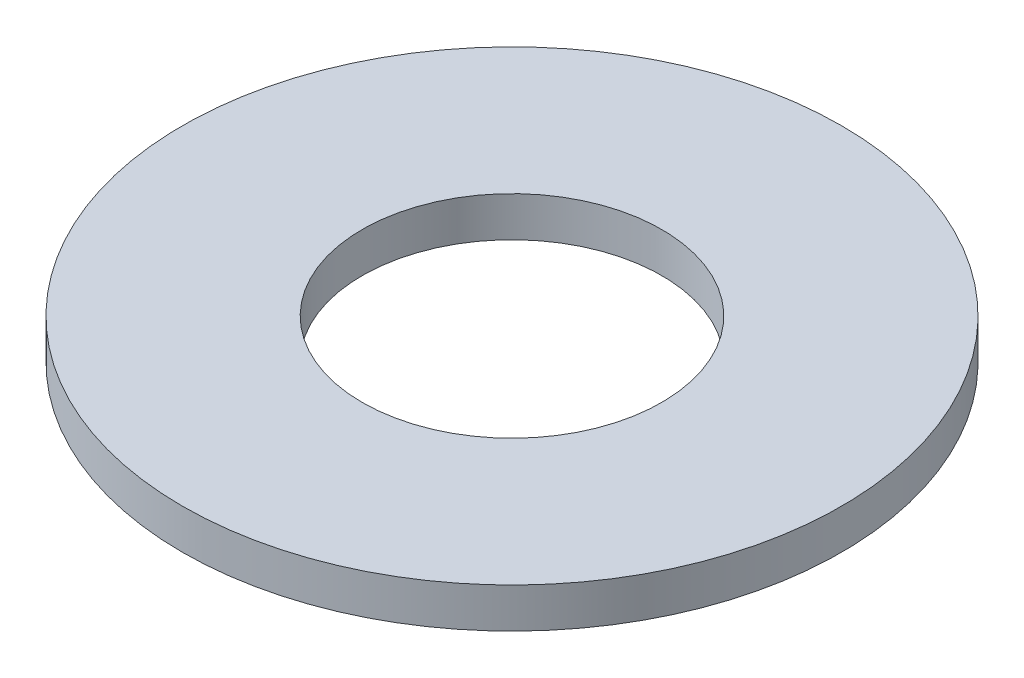
ISO-10303-21;
HEADER;
FILE_DESCRIPTION(('STEP AP214'),'2;1');
FILE_NAME('part.step','',(''),(''),'','','');
FILE_SCHEMA(('AUTOMOTIVE_DESIGN { 1 0 10303 214 1 1 1 1 }'));
ENDSEC;
DATA;
#1=APPLICATION_CONTEXT('core data for automotive mechanical design processes');
#2=APPLICATION_PROTOCOL_DEFINITION('international standard','automotive_design',2000,#1);
#3=PRODUCT_CONTEXT('',#1,'mechanical');
#4=PRODUCT('Part','Part','',(#3));
#5=PRODUCT_RELATED_PRODUCT_CATEGORY('part','',(#4));
#6=PRODUCT_DEFINITION_FORMATION('','',#4);
#7=PRODUCT_DEFINITION_CONTEXT('part definition',#1,'design');
#8=PRODUCT_DEFINITION('design','',#6,#7);
#9=PRODUCT_DEFINITION_SHAPE('','',#8);
#10=(LENGTH_UNIT() NAMED_UNIT(*) SI_UNIT(.MILLI.,.METRE.));
#11=(NAMED_UNIT(*) PLANE_ANGLE_UNIT() SI_UNIT($,.RADIAN.));
#12=(NAMED_UNIT(*) SI_UNIT($,.STERADIAN.) SOLID_ANGLE_UNIT());
#13=UNCERTAINTY_MEASURE_WITH_UNIT(LENGTH_MEASURE(1.E-05),#10,'distance_accuracy_value','');
#14=(GEOMETRIC_REPRESENTATION_CONTEXT(3) GLOBAL_UNCERTAINTY_ASSIGNED_CONTEXT((#13)) GLOBAL_UNIT_ASSIGNED_CONTEXT((#10,
#11,#12)) REPRESENTATION_CONTEXT('',''));
#15=CARTESIAN_POINT('',(0.,0.,0.));
#16=DIRECTION('',(0.,0.,1.));
#17=DIRECTION('',(1.,0.,0.));
#18=AXIS2_PLACEMENT_3D('',#15,#16,#17);
#19=CARTESIAN_POINT('',(0.,5.,0.));
#20=DIRECTION('',(0.,1.,0.));
#21=DIRECTION('',(0.,0.,1.));
#22=AXIS2_PLACEMENT_3D('',#19,#20,#21);
#23=PLANE('',#22);
#24=CARTESIAN_POINT('',(0.,5.,0.));
#25=DIRECTION('',(0.,1.,0.));
#26=DIRECTION('',(0.,0.,1.));
#27=AXIS2_PLACEMENT_3D('',#24,#25,#26);
#28=CIRCLE('',#27,82.5);
#29=CARTESIAN_POINT('',(0.,5.,82.5));
#30=VERTEX_POINT('',#29);
#31=EDGE_CURVE('E10',#30,#30,#28,.T.);
#32=ORIENTED_EDGE('',*,*,#31,.T.);
#33=EDGE_LOOP('',(#32));
#34=FACE_BOUND('',#33,.T.);
#35=CARTESIAN_POINT('',(0.,5.,0.));
#36=DIRECTION('',(0.,1.,0.));
#37=DIRECTION('',(0.,0.,1.));
#38=AXIS2_PLACEMENT_3D('',#35,#36,#37);
#39=CIRCLE('',#38,37.5);
#40=CARTESIAN_POINT('',(0.,5.,37.5));
#41=VERTEX_POINT('',#40);
#42=EDGE_CURVE('E42',#41,#41,#39,.T.);
#43=ORIENTED_EDGE('',*,*,#42,.F.);
#44=EDGE_LOOP('',(#43));
#45=FACE_BOUND('',#44,.T.);
#46=ADVANCED_FACE('F31',(#34,#45),#23,.T.);
#47=CARTESIAN_POINT('',(0.,-5.,0.));
#48=DIRECTION('',(0.,1.,0.));
#49=DIRECTION('',(0.,0.,1.));
#50=AXIS2_PLACEMENT_3D('',#47,#48,#49);
#51=PLANE('',#50);
#52=CARTESIAN_POINT('',(0.,-5.,0.));
#53=DIRECTION('',(0.,1.,0.));
#54=DIRECTION('',(0.,0.,1.));
#55=AXIS2_PLACEMENT_3D('',#52,#53,#54);
#56=CIRCLE('',#55,82.5);
#57=CARTESIAN_POINT('',(0.,-5.,82.5));
#58=VERTEX_POINT('',#57);
#59=EDGE_CURVE('E35',#58,#58,#56,.T.);
#60=ORIENTED_EDGE('',*,*,#59,.F.);
#61=EDGE_LOOP('',(#60));
#62=FACE_BOUND('',#61,.T.);
#63=CARTESIAN_POINT('',(0.,-5.,0.));
#64=DIRECTION('',(0.,1.,0.));
#65=DIRECTION('',(0.,0.,1.));
#66=AXIS2_PLACEMENT_3D('',#63,#64,#65);
#67=CIRCLE('',#66,37.5);
#68=CARTESIAN_POINT('',(0.,-5.,37.5));
#69=VERTEX_POINT('',#68);
#70=EDGE_CURVE('E44',#69,#69,#67,.T.);
#71=ORIENTED_EDGE('',*,*,#70,.T.);
#72=EDGE_LOOP('',(#71));
#73=FACE_BOUND('',#72,.T.);
#74=ADVANCED_FACE('F54',(#62,#73),#51,.F.);
#75=CARTESIAN_POINT('',(0.,5.,0.));
#76=DIRECTION('',(0.,-1.,0.));
#77=DIRECTION('',(0.,0.,-1.));
#78=AXIS2_PLACEMENT_3D('',#75,#76,#77);
#79=CYLINDRICAL_SURFACE('',#78,82.5);
#80=ORIENTED_EDGE('',*,*,#31,.F.);
#81=EDGE_LOOP('',(#80));
#82=FACE_BOUND('',#81,.T.);
#83=ORIENTED_EDGE('',*,*,#59,.T.);
#84=EDGE_LOOP('',(#83));
#85=FACE_BOUND('',#84,.T.);
#86=ADVANCED_FACE('F33',(#82,#85),#79,.T.);
#87=CARTESIAN_POINT('',(0.,5.,0.));
#88=DIRECTION('',(0.,-1.,0.));
#89=DIRECTION('',(0.,0.,-1.));
#90=AXIS2_PLACEMENT_3D('',#87,#88,#89);
#91=CYLINDRICAL_SURFACE('',#90,37.5);
#92=ORIENTED_EDGE('',*,*,#42,.T.);
#93=EDGE_LOOP('',(#92));
#94=FACE_BOUND('',#93,.T.);
#95=ORIENTED_EDGE('',*,*,#70,.F.);
#96=EDGE_LOOP('',(#95));
#97=FACE_BOUND('',#96,.T.);
#98=ADVANCED_FACE('F50',(#94,#97),#91,.F.);
#99=CLOSED_SHELL('',(#46,#74,#86,#98));
#100=MANIFOLD_SOLID_BREP('B2',#99);
#101=ADVANCED_BREP_SHAPE_REPRESENTATION('',(#18,#100),#14);
#102=SHAPE_DEFINITION_REPRESENTATION(#9,#101);
ENDSEC;
END-ISO-10303-21;
